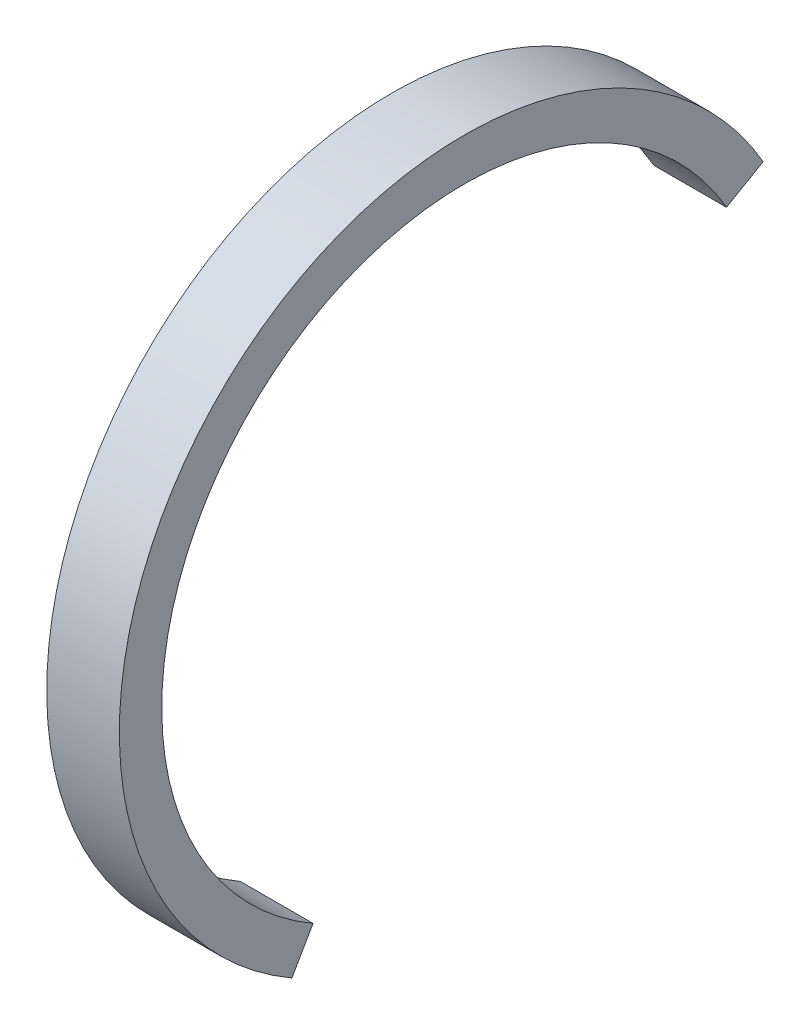
ISO-10303-21;
HEADER;
FILE_DESCRIPTION(('STEP AP214'),'2;1');
FILE_NAME('part.step','',(''),(''),'','','');
FILE_SCHEMA(('AUTOMOTIVE_DESIGN { 1 0 10303 214 1 1 1 1 }'));
ENDSEC;
DATA;
#1=APPLICATION_CONTEXT('core data for automotive mechanical design processes');
#2=APPLICATION_PROTOCOL_DEFINITION('international standard','automotive_design',2000,#1);
#3=PRODUCT_CONTEXT('',#1,'mechanical');
#4=PRODUCT('Part','Part','',(#3));
#5=PRODUCT_RELATED_PRODUCT_CATEGORY('part','',(#4));
#6=PRODUCT_DEFINITION_FORMATION('','',#4);
#7=PRODUCT_DEFINITION_CONTEXT('part definition',#1,'design');
#8=PRODUCT_DEFINITION('design','',#6,#7);
#9=PRODUCT_DEFINITION_SHAPE('','',#8);
#10=(LENGTH_UNIT() NAMED_UNIT(*) SI_UNIT(.MILLI.,.METRE.));
#11=(NAMED_UNIT(*) PLANE_ANGLE_UNIT() SI_UNIT($,.RADIAN.));
#12=(NAMED_UNIT(*) SI_UNIT($,.STERADIAN.) SOLID_ANGLE_UNIT());
#13=UNCERTAINTY_MEASURE_WITH_UNIT(LENGTH_MEASURE(1.E-05),#10,'distance_accuracy_value','');
#14=(GEOMETRIC_REPRESENTATION_CONTEXT(3) GLOBAL_UNCERTAINTY_ASSIGNED_CONTEXT((#13)) GLOBAL_UNIT_ASSIGNED_CONTEXT((#10,
#11,#12)) REPRESENTATION_CONTEXT('',''));
#15=CARTESIAN_POINT('',(0.,0.,0.));
#16=DIRECTION('',(0.,0.,1.));
#17=DIRECTION('',(1.,0.,0.));
#18=AXIS2_PLACEMENT_3D('',#15,#16,#17);
#19=CARTESIAN_POINT('',(6.,0.,0.));
#20=DIRECTION('',(-1.,0.,0.));
#21=DIRECTION('',(0.,0.,1.));
#22=AXIS2_PLACEMENT_3D('',#19,#20,#21);
#23=CYLINDRICAL_SURFACE('',#22,28.5);
#24=CARTESIAN_POINT('',(0.,0.,0.));
#25=DIRECTION('',(1.,0.,0.));
#26=DIRECTION('',(0.,0.,-1.));
#27=AXIS2_PLACEMENT_3D('',#24,#25,#26);
#28=CIRCLE('',#27,28.5);
#29=CARTESIAN_POINT('',(0.,14.25,-24.6817240078565));
#30=VERTEX_POINT('',#29);
#31=CARTESIAN_POINT('',(0.,-24.6817240078564,14.2500000000001));
#32=VERTEX_POINT('',#31);
#33=EDGE_CURVE('E100',#30,#32,#28,.T.);
#34=ORIENTED_EDGE('',*,*,#33,.T.);
#35=DIRECTION('',(-1.,0.,0.));
#36=VECTOR('',#35,1.);
#37=CARTESIAN_POINT('',(6.,-24.6817240078564,14.2500000000001));
#38=LINE('',#37,#36);
#39=CARTESIAN_POINT('',(6.,-24.6817240078564,14.2500000000001));
#40=VERTEX_POINT('',#39);
#41=EDGE_CURVE('E11',#40,#32,#38,.T.);
#42=ORIENTED_EDGE('',*,*,#41,.F.);
#43=CARTESIAN_POINT('',(6.,0.,0.));
#44=DIRECTION('',(1.,0.,0.));
#45=DIRECTION('',(0.,0.,-1.));
#46=AXIS2_PLACEMENT_3D('',#43,#44,#45);
#47=CIRCLE('',#46,28.5);
#48=CARTESIAN_POINT('',(6.,14.25,-24.6817240078565));
#49=VERTEX_POINT('',#48);
#50=EDGE_CURVE('E88',#49,#40,#47,.T.);
#51=ORIENTED_EDGE('',*,*,#50,.F.);
#52=DIRECTION('',(-1.,0.,0.));
#53=VECTOR('',#52,1.);
#54=CARTESIAN_POINT('',(6.,14.25,-24.6817240078565));
#55=LINE('',#54,#53);
#56=EDGE_CURVE('E96',#49,#30,#55,.T.);
#57=ORIENTED_EDGE('',*,*,#56,.T.);
#58=EDGE_LOOP('',(#34,#42,#51,#57));
#59=FACE_BOUND('',#58,.T.);
#60=ADVANCED_FACE('F37',(#59),#23,.T.);
#61=CARTESIAN_POINT('',(6.,-21.6506350946109,12.5000000000001));
#62=DIRECTION('',(0.,0.500000000000004,0.866025403784436));
#63=DIRECTION('',(0.,-0.866025403784436,0.500000000000004));
#64=AXIS2_PLACEMENT_3D('',#61,#62,#63);
#65=PLANE('',#64);
#66=DIRECTION('',(0.,0.866025403784436,-0.500000000000004));
#67=VECTOR('',#66,1.);
#68=CARTESIAN_POINT('',(0.,-21.6506350946109,12.5000000000001));
#69=LINE('',#68,#67);
#70=CARTESIAN_POINT('',(0.,-21.6506350946109,12.5000000000001));
#71=VERTEX_POINT('',#70);
#72=EDGE_CURVE('E92',#32,#71,#69,.T.);
#73=ORIENTED_EDGE('',*,*,#72,.T.);
#74=DIRECTION('',(-1.,0.,0.));
#75=VECTOR('',#74,1.);
#76=CARTESIAN_POINT('',(6.,-21.6506350946109,12.5000000000001));
#77=LINE('',#76,#75);
#78=CARTESIAN_POINT('',(6.,-21.6506350946109,12.5000000000001));
#79=VERTEX_POINT('',#78);
#80=EDGE_CURVE('E45',#79,#71,#77,.T.);
#81=ORIENTED_EDGE('',*,*,#80,.F.);
#82=DIRECTION('',(0.,0.866025403784436,-0.500000000000004));
#83=VECTOR('',#82,1.);
#84=CARTESIAN_POINT('',(6.,-21.6506350946109,12.5000000000001));
#85=LINE('',#84,#83);
#86=EDGE_CURVE('E83',#40,#79,#85,.T.);
#87=ORIENTED_EDGE('',*,*,#86,.F.);
#88=ORIENTED_EDGE('',*,*,#41,.T.);
#89=EDGE_LOOP('',(#73,#81,#87,#88));
#90=FACE_BOUND('',#89,.T.);
#91=ADVANCED_FACE('F91',(#90),#65,.F.);
#92=CARTESIAN_POINT('',(6.,0.,0.));
#93=DIRECTION('',(-1.,0.,0.));
#94=DIRECTION('',(0.,0.,1.));
#95=AXIS2_PLACEMENT_3D('',#92,#93,#94);
#96=CYLINDRICAL_SURFACE('',#95,25.);
#97=CARTESIAN_POINT('',(0.,0.,0.));
#98=DIRECTION('',(-1.,0.,0.));
#99=DIRECTION('',(0.,0.,-1.));
#100=AXIS2_PLACEMENT_3D('',#97,#98,#99);
#101=CIRCLE('',#100,25.);
#102=CARTESIAN_POINT('',(0.,12.5,-21.6506350946109));
#103=VERTEX_POINT('',#102);
#104=EDGE_CURVE('E70',#71,#103,#101,.T.);
#105=ORIENTED_EDGE('',*,*,#104,.T.);
#106=DIRECTION('',(-1.,0.,0.));
#107=VECTOR('',#106,1.);
#108=CARTESIAN_POINT('',(6.,12.5,-21.6506350946109));
#109=LINE('',#108,#107);
#110=CARTESIAN_POINT('',(6.,12.5,-21.6506350946109));
#111=VERTEX_POINT('',#110);
#112=EDGE_CURVE('E93',#111,#103,#109,.T.);
#113=ORIENTED_EDGE('',*,*,#112,.F.);
#114=CARTESIAN_POINT('',(6.,0.,0.));
#115=DIRECTION('',(-1.,0.,0.));
#116=DIRECTION('',(0.,0.,-1.));
#117=AXIS2_PLACEMENT_3D('',#114,#115,#116);
#118=CIRCLE('',#117,25.);
#119=EDGE_CURVE('E86',#79,#111,#118,.T.);
#120=ORIENTED_EDGE('',*,*,#119,.F.);
#121=ORIENTED_EDGE('',*,*,#80,.T.);
#122=EDGE_LOOP('',(#105,#113,#120,#121));
#123=FACE_BOUND('',#122,.T.);
#124=ADVANCED_FACE('F94',(#123),#96,.F.);
#125=CARTESIAN_POINT('',(6.,12.5,-21.6506350946109));
#126=DIRECTION('',(0.,0.866025403784438,0.500000000000001));
#127=DIRECTION('',(0.,-0.500000000000001,0.866025403784438));
#128=AXIS2_PLACEMENT_3D('',#125,#126,#127);
#129=PLANE('',#128);
#130=DIRECTION('',(0.,0.500000000000001,-0.866025403784438));
#131=VECTOR('',#130,1.);
#132=CARTESIAN_POINT('',(0.,12.5,-21.6506350946109));
#133=LINE('',#132,#131);
#134=EDGE_CURVE('E76',#103,#30,#133,.T.);
#135=ORIENTED_EDGE('',*,*,#134,.T.);
#136=ORIENTED_EDGE('',*,*,#56,.F.);
#137=DIRECTION('',(0.,0.500000000000001,-0.866025403784438));
#138=VECTOR('',#137,1.);
#139=CARTESIAN_POINT('',(6.,12.5,-21.6506350946109));
#140=LINE('',#139,#138);
#141=EDGE_CURVE('E53',#111,#49,#140,.T.);
#142=ORIENTED_EDGE('',*,*,#141,.F.);
#143=ORIENTED_EDGE('',*,*,#112,.T.);
#144=EDGE_LOOP('',(#135,#136,#142,#143));
#145=FACE_BOUND('',#144,.T.);
#146=ADVANCED_FACE('F107',(#145),#129,.F.);
#147=CARTESIAN_POINT('',(6.,0.,0.));
#148=DIRECTION('',(1.,0.,0.));
#149=DIRECTION('',(0.,0.,-1.));
#150=AXIS2_PLACEMENT_3D('',#147,#148,#149);
#151=PLANE('',#150);
#152=ORIENTED_EDGE('',*,*,#50,.T.);
#153=ORIENTED_EDGE('',*,*,#86,.T.);
#154=ORIENTED_EDGE('',*,*,#119,.T.);
#155=ORIENTED_EDGE('',*,*,#141,.T.);
#156=EDGE_LOOP('',(#152,#153,#154,#155));
#157=FACE_BOUND('',#156,.T.);
#158=ADVANCED_FACE('F84',(#157),#151,.T.);
#159=CARTESIAN_POINT('',(0.,0.,0.));
#160=DIRECTION('',(1.,0.,0.));
#161=DIRECTION('',(0.,0.,-1.));
#162=AXIS2_PLACEMENT_3D('',#159,#160,#161);
#163=PLANE('',#162);
#164=ORIENTED_EDGE('',*,*,#33,.F.);
#165=ORIENTED_EDGE('',*,*,#134,.F.);
#166=ORIENTED_EDGE('',*,*,#104,.F.);
#167=ORIENTED_EDGE('',*,*,#72,.F.);
#168=EDGE_LOOP('',(#164,#165,#166,#167));
#169=FACE_BOUND('',#168,.T.);
#170=ADVANCED_FACE('F110',(#169),#163,.F.);
#171=CLOSED_SHELL('',(#60,#91,#124,#146,#158,#170));
#172=MANIFOLD_SOLID_BREP('B2',#171);
#173=ADVANCED_BREP_SHAPE_REPRESENTATION('',(#18,#172),#14);
#174=SHAPE_DEFINITION_REPRESENTATION(#9,#173);
ENDSEC;
END-ISO-10303-21;
